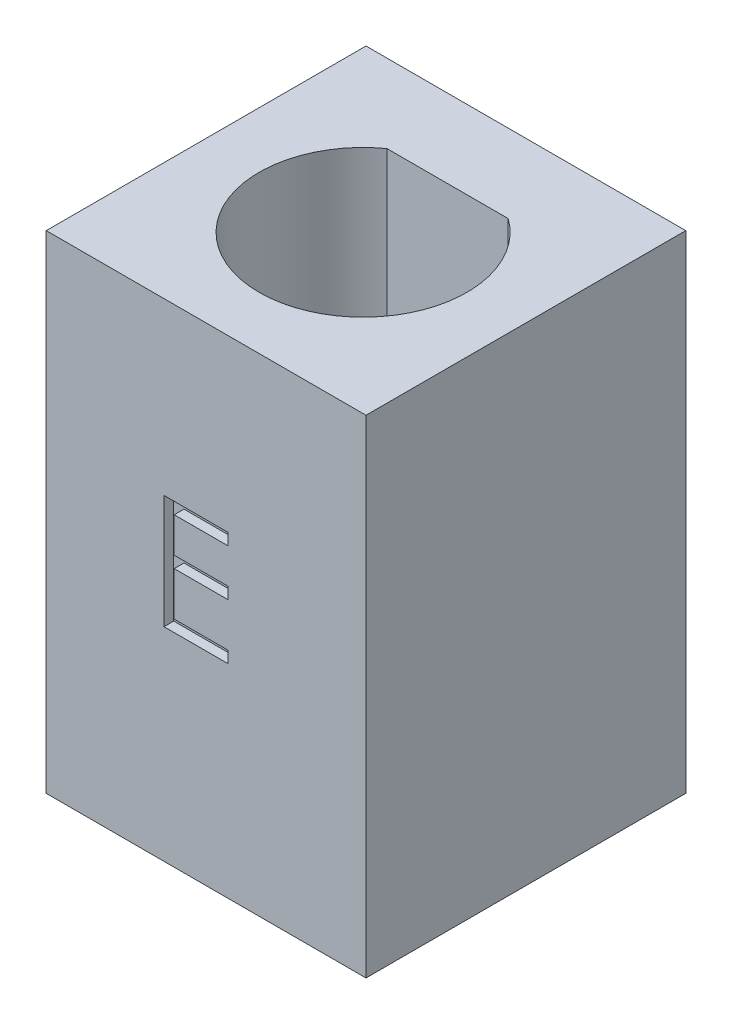
ISO-10303-21;
HEADER;
FILE_DESCRIPTION(('STEP AP214'),'2;1');
FILE_NAME('part.step','',(''),(''),'','','');
FILE_SCHEMA(('AUTOMOTIVE_DESIGN { 1 0 10303 214 1 1 1 1 }'));
ENDSEC;
DATA;
#1=APPLICATION_CONTEXT('core data for automotive mechanical design processes');
#2=APPLICATION_PROTOCOL_DEFINITION('international standard','automotive_design',2000,#1);
#3=PRODUCT_CONTEXT('',#1,'mechanical');
#4=PRODUCT('Part','Part','',(#3));
#5=PRODUCT_RELATED_PRODUCT_CATEGORY('part','',(#4));
#6=PRODUCT_DEFINITION_FORMATION('','',#4);
#7=PRODUCT_DEFINITION_CONTEXT('part definition',#1,'design');
#8=PRODUCT_DEFINITION('design','',#6,#7);
#9=PRODUCT_DEFINITION_SHAPE('','',#8);
#10=(LENGTH_UNIT() NAMED_UNIT(*) SI_UNIT(.MILLI.,.METRE.));
#11=(NAMED_UNIT(*) PLANE_ANGLE_UNIT() SI_UNIT($,.RADIAN.));
#12=(NAMED_UNIT(*) SI_UNIT($,.STERADIAN.) SOLID_ANGLE_UNIT());
#13=UNCERTAINTY_MEASURE_WITH_UNIT(LENGTH_MEASURE(1.E-05),#10,'distance_accuracy_value','');
#14=(GEOMETRIC_REPRESENTATION_CONTEXT(3) GLOBAL_UNCERTAINTY_ASSIGNED_CONTEXT((#13)) GLOBAL_UNIT_ASSIGNED_CONTEXT((#10,
#11,#12)) REPRESENTATION_CONTEXT('',''));
#15=CARTESIAN_POINT('',(0.,0.,0.));
#16=DIRECTION('',(0.,0.,1.));
#17=DIRECTION('',(1.,0.,0.));
#18=AXIS2_PLACEMENT_3D('',#15,#16,#17);
#19=CARTESIAN_POINT('',(-4.92071142032593,15.,4.92071142032593));
#20=DIRECTION('',(0.,0.,-1.));
#21=DIRECTION('',(-1.,0.,0.));
#22=AXIS2_PLACEMENT_3D('',#19,#20,#21);
#23=PLANE('',#22);
#24=DIRECTION('',(1.,0.,0.));
#25=VECTOR('',#24,1.);
#26=CARTESIAN_POINT('',(-4.92071142032593,0.,4.92071142032593));
#27=LINE('',#26,#25);
#28=CARTESIAN_POINT('',(-4.92071142032593,0.,4.92071142032593));
#29=VERTEX_POINT('',#28);
#30=CARTESIAN_POINT('',(4.92071142032593,0.,4.92071142032593));
#31=VERTEX_POINT('',#30);
#32=EDGE_CURVE('E246',#29,#31,#27,.T.);
#33=ORIENTED_EDGE('',*,*,#32,.T.);
#34=DIRECTION('',(0.,-1.,0.));
#35=VECTOR('',#34,1.);
#36=CARTESIAN_POINT('',(4.92071142032593,15.,4.92071142032593));
#37=LINE('',#36,#35);
#38=CARTESIAN_POINT('',(4.92071142032593,15.,4.92071142032593));
#39=VERTEX_POINT('',#38);
#40=EDGE_CURVE('E56',#39,#31,#37,.T.);
#41=ORIENTED_EDGE('',*,*,#40,.F.);
#42=DIRECTION('',(1.,0.,0.));
#43=VECTOR('',#42,1.);
#44=CARTESIAN_POINT('',(-4.92071142032593,15.,4.92071142032593));
#45=LINE('',#44,#43);
#46=CARTESIAN_POINT('',(-4.92071142032593,15.,4.92071142032593));
#47=VERTEX_POINT('',#46);
#48=EDGE_CURVE('E232',#47,#39,#45,.T.);
#49=ORIENTED_EDGE('',*,*,#48,.F.);
#50=DIRECTION('',(0.,-1.,0.));
#51=VECTOR('',#50,1.);
#52=CARTESIAN_POINT('',(-4.92071142032593,15.,4.92071142032593));
#53=LINE('',#52,#51);
#54=EDGE_CURVE('E11',#47,#29,#53,.T.);
#55=ORIENTED_EDGE('',*,*,#54,.T.);
#56=EDGE_LOOP('',(#33,#41,#49,#55));
#57=FACE_BOUND('',#56,.T.);
#58=DIRECTION('',(0.,1.,0.));
#59=VECTOR('',#58,1.);
#60=CARTESIAN_POINT('',(-1.29636242821565,6.25483865440246,4.92071142032593));
#61=LINE('',#60,#59);
#62=CARTESIAN_POINT('',(-1.29636242821565,6.25483865440247,4.92071142032593));
#63=VERTEX_POINT('',#62);
#64=CARTESIAN_POINT('',(-1.29636242821565,9.75483865440246,4.92071142032593));
#65=VERTEX_POINT('',#64);
#66=EDGE_CURVE('E63',#63,#65,#61,.T.);
#67=ORIENTED_EDGE('',*,*,#66,.T.);
#68=DIRECTION('',(1.,0.,0.));
#69=VECTOR('',#68,1.);
#70=CARTESIAN_POINT('',(-1.29636242821565,9.75483865440246,4.92071142032593));
#71=LINE('',#70,#69);
#72=CARTESIAN_POINT('',(0.677996546143321,9.75483865440246,4.92071142032593));
#73=VERTEX_POINT('',#72);
#74=EDGE_CURVE('E195',#65,#73,#71,.T.);
#75=ORIENTED_EDGE('',*,*,#74,.T.);
#76=DIRECTION('',(0.,-1.,0.));
#77=VECTOR('',#76,1.);
#78=CARTESIAN_POINT('',(0.677996546143321,9.75483865440246,4.92071142032593));
#79=LINE('',#78,#77);
#80=CARTESIAN_POINT('',(0.677996546143321,9.39586429542811,4.92071142032593));
#81=VERTEX_POINT('',#80);
#82=EDGE_CURVE('E297',#73,#81,#79,.T.);
#83=ORIENTED_EDGE('',*,*,#82,.T.);
#84=DIRECTION('',(-1.,0.,0.));
#85=VECTOR('',#84,1.);
#86=CARTESIAN_POINT('',(0.677996546143321,9.39586429542811,4.92071142032593));
#87=LINE('',#86,#85);
#88=CARTESIAN_POINT('',(-0.982259864113089,9.39586429542811,4.92071142032593));
#89=VERTEX_POINT('',#88);
#90=EDGE_CURVE('E305',#81,#89,#87,.T.);
#91=ORIENTED_EDGE('',*,*,#90,.T.);
#92=DIRECTION('',(0.,-1.,0.));
#93=VECTOR('',#92,1.);
#94=CARTESIAN_POINT('',(-0.982259864113089,9.39586429542811,4.92071142032593));
#95=LINE('',#94,#93);
#96=CARTESIAN_POINT('',(-0.982259864113089,8.31894121850503,4.92071142032593));
#97=VERTEX_POINT('',#96);
#98=EDGE_CURVE('E309',#89,#97,#95,.T.);
#99=ORIENTED_EDGE('',*,*,#98,.T.);
#100=DIRECTION('',(1.,0.,0.));
#101=VECTOR('',#100,1.);
#102=CARTESIAN_POINT('',(-0.982259864113089,8.31894121850503,4.92071142032593));
#103=LINE('',#102,#101);
#104=CARTESIAN_POINT('',(0.677996546143321,8.31894121850503,4.92071142032593));
#105=VERTEX_POINT('',#104);
#106=EDGE_CURVE('E313',#97,#105,#103,.T.);
#107=ORIENTED_EDGE('',*,*,#106,.T.);
#108=DIRECTION('',(0.,-1.,0.));
#109=VECTOR('',#108,1.);
#110=CARTESIAN_POINT('',(0.677996546143321,8.31894121850503,4.92071142032593));
#111=LINE('',#110,#109);
#112=CARTESIAN_POINT('',(0.677996546143321,7.95996685953067,4.92071142032593));
#113=VERTEX_POINT('',#112);
#114=EDGE_CURVE('E316',#105,#113,#111,.T.);
#115=ORIENTED_EDGE('',*,*,#114,.T.);
#116=DIRECTION('',(-1.,0.,0.));
#117=VECTOR('',#116,1.);
#118=CARTESIAN_POINT('',(0.677996546143321,7.95996685953067,4.92071142032593));
#119=LINE('',#118,#117);
#120=CARTESIAN_POINT('',(-0.982259864113089,7.95996685953067,4.92071142032593));
#121=VERTEX_POINT('',#120);
#122=EDGE_CURVE('E320',#113,#121,#119,.T.);
#123=ORIENTED_EDGE('',*,*,#122,.T.);
#124=DIRECTION('',(0.,-1.,0.));
#125=VECTOR('',#124,1.);
#126=CARTESIAN_POINT('',(-0.982259864113089,7.95996685953067,4.92071142032593));
#127=LINE('',#126,#125);
#128=CARTESIAN_POINT('',(-0.982259864113089,6.61381301337682,4.92071142032593));
#129=VERTEX_POINT('',#128);
#130=EDGE_CURVE('E324',#121,#129,#127,.T.);
#131=ORIENTED_EDGE('',*,*,#130,.T.);
#132=DIRECTION('',(1.,0.,0.));
#133=VECTOR('',#132,1.);
#134=CARTESIAN_POINT('',(-0.982259864113089,6.61381301337682,4.92071142032593));
#135=LINE('',#134,#133);
#136=CARTESIAN_POINT('',(0.677996546143321,6.61381301337682,4.92071142032593));
#137=VERTEX_POINT('',#136);
#138=EDGE_CURVE('E328',#129,#137,#135,.T.);
#139=ORIENTED_EDGE('',*,*,#138,.T.);
#140=DIRECTION('',(0.,-1.,0.));
#141=VECTOR('',#140,1.);
#142=CARTESIAN_POINT('',(0.677996546143321,6.61381301337682,4.92071142032593));
#143=LINE('',#142,#141);
#144=CARTESIAN_POINT('',(0.677996546143321,6.25483865440246,4.92071142032593));
#145=VERTEX_POINT('',#144);
#146=EDGE_CURVE('E332',#137,#145,#143,.T.);
#147=ORIENTED_EDGE('',*,*,#146,.T.);
#148=DIRECTION('',(-1.,0.,0.));
#149=VECTOR('',#148,1.);
#150=CARTESIAN_POINT('',(0.677996546143321,6.25483865440246,4.92071142032593));
#151=LINE('',#150,#149);
#152=EDGE_CURVE('E191',#145,#63,#151,.T.);
#153=ORIENTED_EDGE('',*,*,#152,.T.);
#154=EDGE_LOOP('',(#67,#75,#83,#91,#99,#107,#115,#123,#131,#139,#147,#153));
#155=FACE_BOUND('',#154,.T.);
#156=ADVANCED_FACE('F47',(#57,#155),#23,.F.);
#157=CARTESIAN_POINT('',(0.,15.,0.));
#158=DIRECTION('',(0.,1.,0.));
#159=DIRECTION('',(0.,0.,1.));
#160=AXIS2_PLACEMENT_3D('',#157,#158,#159);
#161=PLANE('',#160);
#162=DIRECTION('',(0.,0.,1.));
#163=VECTOR('',#162,1.);
#164=CARTESIAN_POINT('',(-4.92071142032593,15.,-4.92071142032593));
#165=LINE('',#164,#163);
#166=CARTESIAN_POINT('',(-4.92071142032593,15.,-4.92071142032593));
#167=VERTEX_POINT('',#166);
#168=EDGE_CURVE('E228',#167,#47,#165,.T.);
#169=ORIENTED_EDGE('',*,*,#168,.T.);
#170=ORIENTED_EDGE('',*,*,#48,.T.);
#171=DIRECTION('',(0.,0.,-1.));
#172=VECTOR('',#171,1.);
#173=CARTESIAN_POINT('',(4.92071142032593,15.,-4.92071142032593));
#174=LINE('',#173,#172);
#175=CARTESIAN_POINT('',(4.92071142032593,15.,-4.92071142032593));
#176=VERTEX_POINT('',#175);
#177=EDGE_CURVE('E236',#39,#176,#174,.T.);
#178=ORIENTED_EDGE('',*,*,#177,.T.);
#179=DIRECTION('',(-1.,0.,0.));
#180=VECTOR('',#179,1.);
#181=CARTESIAN_POINT('',(-4.92071142032593,15.,-4.92071142032593));
#182=LINE('',#181,#180);
#183=EDGE_CURVE('E239',#176,#167,#182,.T.);
#184=ORIENTED_EDGE('',*,*,#183,.T.);
#185=EDGE_LOOP('',(#169,#170,#178,#184));
#186=FACE_BOUND('',#185,.T.);
#187=DIRECTION('',(-1.,0.,0.));
#188=VECTOR('',#187,1.);
#189=CARTESIAN_POINT('',(-1.86547581061776,15.,-2.50944482217004));
#190=LINE('',#189,#188);
#191=CARTESIAN_POINT('',(1.86547581061776,15.,-2.50944482217004));
#192=VERTEX_POINT('',#191);
#193=CARTESIAN_POINT('',(-1.86547581061776,15.,-2.50944482217004));
#194=VERTEX_POINT('',#193);
#195=EDGE_CURVE('E215',#192,#194,#190,.T.);
#196=ORIENTED_EDGE('',*,*,#195,.F.);
#197=CARTESIAN_POINT('',(0.,15.,0.0905551778299627));
#198=DIRECTION('',(0.,1.,0.));
#199=DIRECTION('',(0.,0.,1.));
#200=AXIS2_PLACEMENT_3D('',#197,#198,#199);
#201=CIRCLE('',#200,3.2);
#202=EDGE_CURVE('E212',#194,#192,#201,.T.);
#203=ORIENTED_EDGE('',*,*,#202,.F.);
#204=EDGE_LOOP('',(#196,#203));
#205=FACE_BOUND('',#204,.T.);
#206=ADVANCED_FACE('F284',(#186,#205),#161,.T.);
#207=CARTESIAN_POINT('',(0.,0.,0.));
#208=DIRECTION('',(0.,1.,0.));
#209=DIRECTION('',(0.,0.,1.));
#210=AXIS2_PLACEMENT_3D('',#207,#208,#209);
#211=PLANE('',#210);
#212=DIRECTION('',(0.,0.,1.));
#213=VECTOR('',#212,1.);
#214=CARTESIAN_POINT('',(-4.92071142032593,0.,-4.92071142032593));
#215=LINE('',#214,#213);
#216=CARTESIAN_POINT('',(-4.92071142032593,0.,-4.92071142032593));
#217=VERTEX_POINT('',#216);
#218=EDGE_CURVE('E227',#217,#29,#215,.T.);
#219=ORIENTED_EDGE('',*,*,#218,.F.);
#220=DIRECTION('',(-1.,0.,0.));
#221=VECTOR('',#220,1.);
#222=CARTESIAN_POINT('',(-4.92071142032593,0.,-4.92071142032593));
#223=LINE('',#222,#221);
#224=CARTESIAN_POINT('',(4.92071142032593,0.,-4.92071142032593));
#225=VERTEX_POINT('',#224);
#226=EDGE_CURVE('E233',#225,#217,#223,.T.);
#227=ORIENTED_EDGE('',*,*,#226,.F.);
#228=DIRECTION('',(0.,0.,-1.));
#229=VECTOR('',#228,1.);
#230=CARTESIAN_POINT('',(4.92071142032593,0.,-4.92071142032593));
#231=LINE('',#230,#229);
#232=EDGE_CURVE('E249',#31,#225,#231,.T.);
#233=ORIENTED_EDGE('',*,*,#232,.F.);
#234=ORIENTED_EDGE('',*,*,#32,.F.);
#235=EDGE_LOOP('',(#219,#227,#233,#234));
#236=FACE_BOUND('',#235,.T.);
#237=CARTESIAN_POINT('',(0.,0.,0.0905551778299627));
#238=DIRECTION('',(0.,1.,0.));
#239=DIRECTION('',(0.,0.,1.));
#240=AXIS2_PLACEMENT_3D('',#237,#238,#239);
#241=CIRCLE('',#240,3.2);
#242=CARTESIAN_POINT('',(-1.86547581061776,0.,-2.50944482217004));
#243=VERTEX_POINT('',#242);
#244=CARTESIAN_POINT('',(1.86547581061776,0.,-2.50944482217004));
#245=VERTEX_POINT('',#244);
#246=EDGE_CURVE('E197',#243,#245,#241,.T.);
#247=ORIENTED_EDGE('',*,*,#246,.T.);
#248=DIRECTION('',(-1.,0.,0.));
#249=VECTOR('',#248,1.);
#250=CARTESIAN_POINT('',(-1.86547581061776,0.,-2.50944482217004));
#251=LINE('',#250,#249);
#252=EDGE_CURVE('E205',#245,#243,#251,.T.);
#253=ORIENTED_EDGE('',*,*,#252,.T.);
#254=EDGE_LOOP('',(#247,#253));
#255=FACE_BOUND('',#254,.T.);
#256=ADVANCED_FACE('F274',(#236,#255),#211,.F.);
#257=CARTESIAN_POINT('',(-4.92071142032593,15.,-4.92071142032593));
#258=DIRECTION('',(1.,0.,0.));
#259=DIRECTION('',(0.,0.,-1.));
#260=AXIS2_PLACEMENT_3D('',#257,#258,#259);
#261=PLANE('',#260);
#262=ORIENTED_EDGE('',*,*,#218,.T.);
#263=ORIENTED_EDGE('',*,*,#54,.F.);
#264=ORIENTED_EDGE('',*,*,#168,.F.);
#265=DIRECTION('',(0.,-1.,0.));
#266=VECTOR('',#265,1.);
#267=CARTESIAN_POINT('',(-4.92071142032593,15.,-4.92071142032593));
#268=LINE('',#267,#266);
#269=EDGE_CURVE('E242',#167,#217,#268,.T.);
#270=ORIENTED_EDGE('',*,*,#269,.T.);
#271=EDGE_LOOP('',(#262,#263,#264,#270));
#272=FACE_BOUND('',#271,.T.);
#273=ADVANCED_FACE('F49',(#272),#261,.F.);
#274=CARTESIAN_POINT('',(4.92071142032593,15.,-4.92071142032593));
#275=DIRECTION('',(-1.,0.,0.));
#276=DIRECTION('',(0.,0.,1.));
#277=AXIS2_PLACEMENT_3D('',#274,#275,#276);
#278=PLANE('',#277);
#279=ORIENTED_EDGE('',*,*,#232,.T.);
#280=DIRECTION('',(0.,-1.,0.));
#281=VECTOR('',#280,1.);
#282=CARTESIAN_POINT('',(4.92071142032593,15.,-4.92071142032593));
#283=LINE('',#282,#281);
#284=EDGE_CURVE('E257',#176,#225,#283,.T.);
#285=ORIENTED_EDGE('',*,*,#284,.F.);
#286=ORIENTED_EDGE('',*,*,#177,.F.);
#287=ORIENTED_EDGE('',*,*,#40,.T.);
#288=EDGE_LOOP('',(#279,#285,#286,#287));
#289=FACE_BOUND('',#288,.T.);
#290=ADVANCED_FACE('F268',(#289),#278,.F.);
#291=CARTESIAN_POINT('',(-4.92071142032593,15.,-4.92071142032593));
#292=DIRECTION('',(0.,0.,1.));
#293=DIRECTION('',(1.,0.,0.));
#294=AXIS2_PLACEMENT_3D('',#291,#292,#293);
#295=PLANE('',#294);
#296=ORIENTED_EDGE('',*,*,#226,.T.);
#297=ORIENTED_EDGE('',*,*,#269,.F.);
#298=ORIENTED_EDGE('',*,*,#183,.F.);
#299=ORIENTED_EDGE('',*,*,#284,.T.);
#300=EDGE_LOOP('',(#296,#297,#298,#299));
#301=FACE_BOUND('',#300,.T.);
#302=ADVANCED_FACE('F278',(#301),#295,.F.);
#303=CARTESIAN_POINT('',(0.,15.,0.0905551778299627));
#304=DIRECTION('',(0.,-1.,0.));
#305=DIRECTION('',(0.,0.,-1.));
#306=AXIS2_PLACEMENT_3D('',#303,#304,#305);
#307=CYLINDRICAL_SURFACE('',#306,3.2);
#308=ORIENTED_EDGE('',*,*,#246,.F.);
#309=DIRECTION('',(0.,-1.,0.));
#310=VECTOR('',#309,1.);
#311=CARTESIAN_POINT('',(-1.86547581061776,15.,-2.50944482217004));
#312=LINE('',#311,#310);
#313=EDGE_CURVE('E217',#194,#243,#312,.T.);
#314=ORIENTED_EDGE('',*,*,#313,.F.);
#315=ORIENTED_EDGE('',*,*,#202,.T.);
#316=DIRECTION('',(0.,-1.,0.));
#317=VECTOR('',#316,1.);
#318=CARTESIAN_POINT('',(1.86547581061776,15.,-2.50944482217004));
#319=LINE('',#318,#317);
#320=EDGE_CURVE('E71',#192,#245,#319,.T.);
#321=ORIENTED_EDGE('',*,*,#320,.T.);
#322=EDGE_LOOP('',(#308,#314,#315,#321));
#323=FACE_BOUND('',#322,.T.);
#324=ADVANCED_FACE('F514',(#323),#307,.F.);
#325=CARTESIAN_POINT('',(-1.86547581061776,15.,-2.50944482217004));
#326=DIRECTION('',(0.,0.,1.));
#327=DIRECTION('',(1.,0.,0.));
#328=AXIS2_PLACEMENT_3D('',#325,#326,#327);
#329=PLANE('',#328);
#330=ORIENTED_EDGE('',*,*,#252,.F.);
#331=ORIENTED_EDGE('',*,*,#320,.F.);
#332=ORIENTED_EDGE('',*,*,#195,.T.);
#333=ORIENTED_EDGE('',*,*,#313,.T.);
#334=EDGE_LOOP('',(#330,#331,#332,#333));
#335=FACE_BOUND('',#334,.T.);
#336=ADVANCED_FACE('F511',(#335),#329,.T.);
#337=CARTESIAN_POINT('',(-1.29636242821565,6.25483865440246,4.62071142032593));
#338=DIRECTION('',(1.,0.,0.));
#339=DIRECTION('',(0.,0.,-1.));
#340=AXIS2_PLACEMENT_3D('',#337,#338,#339);
#341=PLANE('',#340);
#342=ORIENTED_EDGE('',*,*,#66,.F.);
#343=DIRECTION('',(0.,0.,1.));
#344=VECTOR('',#343,1.);
#345=CARTESIAN_POINT('',(-1.29636242821565,6.25483865440246,4.62071142032593));
#346=LINE('',#345,#344);
#347=CARTESIAN_POINT('',(-1.29636242821565,6.25483865440246,4.62071142032593));
#348=VERTEX_POINT('',#347);
#349=EDGE_CURVE('E189',#348,#63,#346,.T.);
#350=ORIENTED_EDGE('',*,*,#349,.F.);
#351=DIRECTION('',(0.,1.,0.));
#352=VECTOR('',#351,1.);
#353=CARTESIAN_POINT('',(-1.29636242821565,6.25483865440246,4.62071142032593));
#354=LINE('',#353,#352);
#355=CARTESIAN_POINT('',(-1.29636242821565,9.75483865440246,4.62071142032593));
#356=VERTEX_POINT('',#355);
#357=EDGE_CURVE('E179',#348,#356,#354,.T.);
#358=ORIENTED_EDGE('',*,*,#357,.T.);
#359=DIRECTION('',(0.,0.,1.));
#360=VECTOR('',#359,1.);
#361=CARTESIAN_POINT('',(-1.29636242821565,9.75483865440246,4.62071142032593));
#362=LINE('',#361,#360);
#363=EDGE_CURVE('E188',#356,#65,#362,.T.);
#364=ORIENTED_EDGE('',*,*,#363,.T.);
#365=EDGE_LOOP('',(#342,#350,#358,#364));
#366=FACE_BOUND('',#365,.T.);
#367=ADVANCED_FACE('F187',(#366),#341,.T.);
#368=CARTESIAN_POINT('',(-1.29636242821565,9.75483865440246,4.62071142032593));
#369=DIRECTION('',(0.,-1.,0.));
#370=DIRECTION('',(0.,0.,-1.));
#371=AXIS2_PLACEMENT_3D('',#368,#369,#370);
#372=PLANE('',#371);
#373=ORIENTED_EDGE('',*,*,#74,.F.);
#374=ORIENTED_EDGE('',*,*,#363,.F.);
#375=DIRECTION('',(1.,0.,0.));
#376=VECTOR('',#375,1.);
#377=CARTESIAN_POINT('',(-1.29636242821565,9.75483865440246,4.62071142032593));
#378=LINE('',#377,#376);
#379=CARTESIAN_POINT('',(0.677996546143321,9.75483865440246,4.62071142032593));
#380=VERTEX_POINT('',#379);
#381=EDGE_CURVE('E175',#356,#380,#378,.T.);
#382=ORIENTED_EDGE('',*,*,#381,.T.);
#383=DIRECTION('',(0.,0.,1.));
#384=VECTOR('',#383,1.);
#385=CARTESIAN_POINT('',(0.677996546143321,9.75483865440246,4.62071142032593));
#386=LINE('',#385,#384);
#387=EDGE_CURVE('E198',#380,#73,#386,.T.);
#388=ORIENTED_EDGE('',*,*,#387,.T.);
#389=EDGE_LOOP('',(#373,#374,#382,#388));
#390=FACE_BOUND('',#389,.T.);
#391=ADVANCED_FACE('F193',(#390),#372,.T.);
#392=CARTESIAN_POINT('',(0.677996546143321,9.75483865440246,4.62071142032593));
#393=DIRECTION('',(-1.,0.,0.));
#394=DIRECTION('',(0.,0.,1.));
#395=AXIS2_PLACEMENT_3D('',#392,#393,#394);
#396=PLANE('',#395);
#397=ORIENTED_EDGE('',*,*,#82,.F.);
#398=ORIENTED_EDGE('',*,*,#387,.F.);
#399=DIRECTION('',(0.,-1.,0.));
#400=VECTOR('',#399,1.);
#401=CARTESIAN_POINT('',(0.677996546143321,9.75483865440246,4.62071142032593));
#402=LINE('',#401,#400);
#403=CARTESIAN_POINT('',(0.677996546143321,9.39586429542811,4.62071142032593));
#404=VERTEX_POINT('',#403);
#405=EDGE_CURVE('E181',#380,#404,#402,.T.);
#406=ORIENTED_EDGE('',*,*,#405,.T.);
#407=DIRECTION('',(0.,0.,1.));
#408=VECTOR('',#407,1.);
#409=CARTESIAN_POINT('',(0.677996546143321,9.39586429542811,4.62071142032593));
#410=LINE('',#409,#408);
#411=EDGE_CURVE('E208',#404,#81,#410,.T.);
#412=ORIENTED_EDGE('',*,*,#411,.T.);
#413=EDGE_LOOP('',(#397,#398,#406,#412));
#414=FACE_BOUND('',#413,.T.);
#415=ADVANCED_FACE('F366',(#414),#396,.T.);
#416=CARTESIAN_POINT('',(0.677996546143321,9.39586429542811,4.62071142032593));
#417=DIRECTION('',(0.,1.,0.));
#418=DIRECTION('',(0.,0.,1.));
#419=AXIS2_PLACEMENT_3D('',#416,#417,#418);
#420=PLANE('',#419);
#421=ORIENTED_EDGE('',*,*,#90,.F.);
#422=ORIENTED_EDGE('',*,*,#411,.F.);
#423=DIRECTION('',(-1.,0.,0.));
#424=VECTOR('',#423,1.);
#425=CARTESIAN_POINT('',(0.677996546143321,9.39586429542811,4.62071142032593));
#426=LINE('',#425,#424);
#427=CARTESIAN_POINT('',(-0.982259864113089,9.39586429542811,4.62071142032593));
#428=VERTEX_POINT('',#427);
#429=EDGE_CURVE('E430',#404,#428,#426,.T.);
#430=ORIENTED_EDGE('',*,*,#429,.T.);
#431=DIRECTION('',(0.,0.,1.));
#432=VECTOR('',#431,1.);
#433=CARTESIAN_POINT('',(-0.982259864113089,9.39586429542811,4.62071142032593));
#434=LINE('',#433,#432);
#435=EDGE_CURVE('E358',#428,#89,#434,.T.);
#436=ORIENTED_EDGE('',*,*,#435,.T.);
#437=EDGE_LOOP('',(#421,#422,#430,#436));
#438=FACE_BOUND('',#437,.T.);
#439=ADVANCED_FACE('F368',(#438),#420,.T.);
#440=CARTESIAN_POINT('',(-0.982259864113089,9.39586429542811,4.62071142032593));
#441=DIRECTION('',(-1.,0.,0.));
#442=DIRECTION('',(0.,0.,1.));
#443=AXIS2_PLACEMENT_3D('',#440,#441,#442);
#444=PLANE('',#443);
#445=ORIENTED_EDGE('',*,*,#98,.F.);
#446=ORIENTED_EDGE('',*,*,#435,.F.);
#447=DIRECTION('',(0.,-1.,0.));
#448=VECTOR('',#447,1.);
#449=CARTESIAN_POINT('',(-0.982259864113089,9.39586429542811,4.62071142032593));
#450=LINE('',#449,#448);
#451=CARTESIAN_POINT('',(-0.982259864113089,8.31894121850503,4.62071142032593));
#452=VERTEX_POINT('',#451);
#453=EDGE_CURVE('E376',#428,#452,#450,.T.);
#454=ORIENTED_EDGE('',*,*,#453,.T.);
#455=DIRECTION('',(0.,0.,1.));
#456=VECTOR('',#455,1.);
#457=CARTESIAN_POINT('',(-0.982259864113089,8.31894121850503,4.62071142032593));
#458=LINE('',#457,#456);
#459=EDGE_CURVE('E355',#452,#97,#458,.T.);
#460=ORIENTED_EDGE('',*,*,#459,.T.);
#461=EDGE_LOOP('',(#445,#446,#454,#460));
#462=FACE_BOUND('',#461,.T.);
#463=ADVANCED_FACE('F373',(#462),#444,.T.);
#464=CARTESIAN_POINT('',(-0.982259864113089,8.31894121850503,4.62071142032593));
#465=DIRECTION('',(0.,-1.,0.));
#466=DIRECTION('',(0.,0.,-1.));
#467=AXIS2_PLACEMENT_3D('',#464,#465,#466);
#468=PLANE('',#467);
#469=ORIENTED_EDGE('',*,*,#106,.F.);
#470=ORIENTED_EDGE('',*,*,#459,.F.);
#471=DIRECTION('',(1.,0.,0.));
#472=VECTOR('',#471,1.);
#473=CARTESIAN_POINT('',(-0.982259864113089,8.31894121850503,4.62071142032593));
#474=LINE('',#473,#472);
#475=CARTESIAN_POINT('',(0.677996546143321,8.31894121850503,4.62071142032593));
#476=VERTEX_POINT('',#475);
#477=EDGE_CURVE('E382',#452,#476,#474,.T.);
#478=ORIENTED_EDGE('',*,*,#477,.T.);
#479=DIRECTION('',(0.,0.,1.));
#480=VECTOR('',#479,1.);
#481=CARTESIAN_POINT('',(0.677996546143321,8.31894121850503,4.62071142032593));
#482=LINE('',#481,#480);
#483=EDGE_CURVE('E352',#476,#105,#482,.T.);
#484=ORIENTED_EDGE('',*,*,#483,.T.);
#485=EDGE_LOOP('',(#469,#470,#478,#484));
#486=FACE_BOUND('',#485,.T.);
#487=ADVANCED_FACE('F379',(#486),#468,.T.);
#488=CARTESIAN_POINT('',(0.677996546143321,8.31894121850503,4.62071142032593));
#489=DIRECTION('',(-1.,0.,0.));
#490=DIRECTION('',(0.,0.,1.));
#491=AXIS2_PLACEMENT_3D('',#488,#489,#490);
#492=PLANE('',#491);
#493=ORIENTED_EDGE('',*,*,#114,.F.);
#494=ORIENTED_EDGE('',*,*,#483,.F.);
#495=DIRECTION('',(0.,-1.,0.));
#496=VECTOR('',#495,1.);
#497=CARTESIAN_POINT('',(0.677996546143321,8.31894121850503,4.62071142032593));
#498=LINE('',#497,#496);
#499=CARTESIAN_POINT('',(0.677996546143321,7.95996685953067,4.62071142032593));
#500=VERTEX_POINT('',#499);
#501=EDGE_CURVE('E424',#476,#500,#498,.T.);
#502=ORIENTED_EDGE('',*,*,#501,.T.);
#503=DIRECTION('',(0.,0.,1.));
#504=VECTOR('',#503,1.);
#505=CARTESIAN_POINT('',(0.677996546143321,7.95996685953067,4.62071142032593));
#506=LINE('',#505,#504);
#507=EDGE_CURVE('E349',#500,#113,#506,.T.);
#508=ORIENTED_EDGE('',*,*,#507,.T.);
#509=EDGE_LOOP('',(#493,#494,#502,#508));
#510=FACE_BOUND('',#509,.T.);
#511=ADVANCED_FACE('F385',(#510),#492,.T.);
#512=CARTESIAN_POINT('',(0.677996546143321,7.95996685953067,4.62071142032593));
#513=DIRECTION('',(0.,1.,0.));
#514=DIRECTION('',(0.,0.,1.));
#515=AXIS2_PLACEMENT_3D('',#512,#513,#514);
#516=PLANE('',#515);
#517=ORIENTED_EDGE('',*,*,#122,.F.);
#518=ORIENTED_EDGE('',*,*,#507,.F.);
#519=DIRECTION('',(-1.,0.,0.));
#520=VECTOR('',#519,1.);
#521=CARTESIAN_POINT('',(0.677996546143321,7.95996685953067,4.62071142032593));
#522=LINE('',#521,#520);
#523=CARTESIAN_POINT('',(-0.982259864113089,7.95996685953067,4.62071142032593));
#524=VERTEX_POINT('',#523);
#525=EDGE_CURVE('E393',#500,#524,#522,.T.);
#526=ORIENTED_EDGE('',*,*,#525,.T.);
#527=DIRECTION('',(0.,0.,1.));
#528=VECTOR('',#527,1.);
#529=CARTESIAN_POINT('',(-0.982259864113089,7.95996685953067,4.62071142032593));
#530=LINE('',#529,#528);
#531=EDGE_CURVE('E347',#524,#121,#530,.T.);
#532=ORIENTED_EDGE('',*,*,#531,.T.);
#533=EDGE_LOOP('',(#517,#518,#526,#532));
#534=FACE_BOUND('',#533,.T.);
#535=ADVANCED_FACE('F390',(#534),#516,.T.);
#536=CARTESIAN_POINT('',(-0.982259864113089,7.95996685953067,4.62071142032593));
#537=DIRECTION('',(-1.,0.,0.));
#538=DIRECTION('',(0.,0.,1.));
#539=AXIS2_PLACEMENT_3D('',#536,#537,#538);
#540=PLANE('',#539);
#541=ORIENTED_EDGE('',*,*,#130,.F.);
#542=ORIENTED_EDGE('',*,*,#531,.F.);
#543=DIRECTION('',(0.,-1.,0.));
#544=VECTOR('',#543,1.);
#545=CARTESIAN_POINT('',(-0.982259864113089,7.95996685953067,4.62071142032593));
#546=LINE('',#545,#544);
#547=CARTESIAN_POINT('',(-0.982259864113089,6.61381301337682,4.62071142032593));
#548=VERTEX_POINT('',#547);
#549=EDGE_CURVE('E399',#524,#548,#546,.T.);
#550=ORIENTED_EDGE('',*,*,#549,.T.);
#551=DIRECTION('',(0.,0.,1.));
#552=VECTOR('',#551,1.);
#553=CARTESIAN_POINT('',(-0.982259864113089,6.61381301337682,4.62071142032593));
#554=LINE('',#553,#552);
#555=EDGE_CURVE('E344',#548,#129,#554,.T.);
#556=ORIENTED_EDGE('',*,*,#555,.T.);
#557=EDGE_LOOP('',(#541,#542,#550,#556));
#558=FACE_BOUND('',#557,.T.);
#559=ADVANCED_FACE('F396',(#558),#540,.T.);
#560=CARTESIAN_POINT('',(-0.982259864113089,6.61381301337682,4.62071142032593));
#561=DIRECTION('',(0.,-1.,0.));
#562=DIRECTION('',(0.,0.,-1.));
#563=AXIS2_PLACEMENT_3D('',#560,#561,#562);
#564=PLANE('',#563);
#565=ORIENTED_EDGE('',*,*,#138,.F.);
#566=ORIENTED_EDGE('',*,*,#555,.F.);
#567=DIRECTION('',(1.,0.,0.));
#568=VECTOR('',#567,1.);
#569=CARTESIAN_POINT('',(-0.982259864113089,6.61381301337682,4.62071142032593));
#570=LINE('',#569,#568);
#571=CARTESIAN_POINT('',(0.677996546143321,6.61381301337682,4.62071142032593));
#572=VERTEX_POINT('',#571);
#573=EDGE_CURVE('E416',#548,#572,#570,.T.);
#574=ORIENTED_EDGE('',*,*,#573,.T.);
#575=DIRECTION('',(0.,0.,1.));
#576=VECTOR('',#575,1.);
#577=CARTESIAN_POINT('',(0.677996546143321,6.61381301337682,4.62071142032593));
#578=LINE('',#577,#576);
#579=EDGE_CURVE('E341',#572,#137,#578,.T.);
#580=ORIENTED_EDGE('',*,*,#579,.T.);
#581=EDGE_LOOP('',(#565,#566,#574,#580));
#582=FACE_BOUND('',#581,.T.);
#583=ADVANCED_FACE('F402',(#582),#564,.T.);
#584=CARTESIAN_POINT('',(0.677996546143321,6.61381301337682,4.62071142032593));
#585=DIRECTION('',(-1.,0.,0.));
#586=DIRECTION('',(0.,0.,1.));
#587=AXIS2_PLACEMENT_3D('',#584,#585,#586);
#588=PLANE('',#587);
#589=ORIENTED_EDGE('',*,*,#146,.F.);
#590=ORIENTED_EDGE('',*,*,#579,.F.);
#591=DIRECTION('',(0.,-1.,0.));
#592=VECTOR('',#591,1.);
#593=CARTESIAN_POINT('',(0.677996546143321,6.61381301337682,4.62071142032593));
#594=LINE('',#593,#592);
#595=CARTESIAN_POINT('',(0.677996546143321,6.25483865440246,4.62071142032593));
#596=VERTEX_POINT('',#595);
#597=EDGE_CURVE('E409',#572,#596,#594,.T.);
#598=ORIENTED_EDGE('',*,*,#597,.T.);
#599=DIRECTION('',(0.,0.,1.));
#600=VECTOR('',#599,1.);
#601=CARTESIAN_POINT('',(0.677996546143321,6.25483865440246,4.62071142032593));
#602=LINE('',#601,#600);
#603=EDGE_CURVE('E339',#596,#145,#602,.T.);
#604=ORIENTED_EDGE('',*,*,#603,.T.);
#605=EDGE_LOOP('',(#589,#590,#598,#604));
#606=FACE_BOUND('',#605,.T.);
#607=ADVANCED_FACE('F406',(#606),#588,.T.);
#608=CARTESIAN_POINT('',(0.677996546143321,6.25483865440246,4.62071142032593));
#609=DIRECTION('',(0.,1.,0.));
#610=DIRECTION('',(0.,0.,1.));
#611=AXIS2_PLACEMENT_3D('',#608,#609,#610);
#612=PLANE('',#611);
#613=ORIENTED_EDGE('',*,*,#152,.F.);
#614=ORIENTED_EDGE('',*,*,#603,.F.);
#615=DIRECTION('',(-1.,0.,0.));
#616=VECTOR('',#615,1.);
#617=CARTESIAN_POINT('',(0.677996546143321,6.25483865440246,4.62071142032593));
#618=LINE('',#617,#616);
#619=EDGE_CURVE('E300',#596,#348,#618,.T.);
#620=ORIENTED_EDGE('',*,*,#619,.T.);
#621=ORIENTED_EDGE('',*,*,#349,.T.);
#622=EDGE_LOOP('',(#613,#614,#620,#621));
#623=FACE_BOUND('',#622,.T.);
#624=ADVANCED_FACE('F411',(#623),#612,.T.);
#625=CARTESIAN_POINT('',(0.,0.,4.62071142032593));
#626=DIRECTION('',(0.,0.,-1.));
#627=DIRECTION('',(-1.,0.,0.));
#628=AXIS2_PLACEMENT_3D('',#625,#626,#627);
#629=PLANE('',#628);
#630=ORIENTED_EDGE('',*,*,#357,.F.);
#631=ORIENTED_EDGE('',*,*,#619,.F.);
#632=ORIENTED_EDGE('',*,*,#597,.F.);
#633=ORIENTED_EDGE('',*,*,#573,.F.);
#634=ORIENTED_EDGE('',*,*,#549,.F.);
#635=ORIENTED_EDGE('',*,*,#525,.F.);
#636=ORIENTED_EDGE('',*,*,#501,.F.);
#637=ORIENTED_EDGE('',*,*,#477,.F.);
#638=ORIENTED_EDGE('',*,*,#453,.F.);
#639=ORIENTED_EDGE('',*,*,#429,.F.);
#640=ORIENTED_EDGE('',*,*,#405,.F.);
#641=ORIENTED_EDGE('',*,*,#381,.F.);
#642=EDGE_LOOP('',(#630,#631,#632,#633,#634,#635,#636,#637,#638,#639,#640,#641));
#643=FACE_BOUND('',#642,.T.);
#644=ADVANCED_FACE('F177',(#643),#629,.F.);
#645=CLOSED_SHELL('',(#156,#206,#256,#273,#290,#302,#324,#336,#367,#391,#415,#439,#463,#487,
#511,#535,#559,#583,#607,#624,#644));
#646=MANIFOLD_SOLID_BREP('B2',#645);
#647=ADVANCED_BREP_SHAPE_REPRESENTATION('',(#18,#646),#14);
#648=SHAPE_DEFINITION_REPRESENTATION(#9,#647);
ENDSEC;
END-ISO-10303-21;
